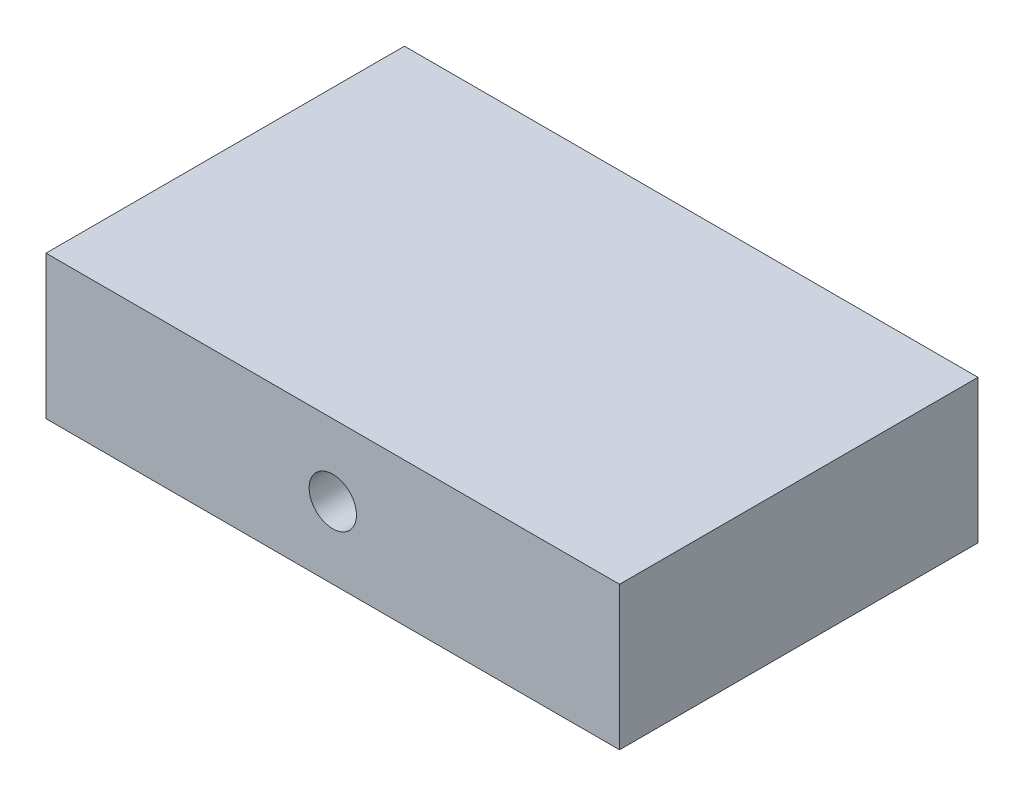
ISO-10303-21;
HEADER;
FILE_DESCRIPTION(('STEP AP214'),'2;1');
FILE_NAME('part.step','',(''),(''),'','','');
FILE_SCHEMA(('AUTOMOTIVE_DESIGN { 1 0 10303 214 1 1 1 1 }'));
ENDSEC;
DATA;
#1=APPLICATION_CONTEXT('core data for automotive mechanical design processes');
#2=APPLICATION_PROTOCOL_DEFINITION('international standard','automotive_design',2000,#1);
#3=PRODUCT_CONTEXT('',#1,'mechanical');
#4=PRODUCT('Part','Part','',(#3));
#5=PRODUCT_RELATED_PRODUCT_CATEGORY('part','',(#4));
#6=PRODUCT_DEFINITION_FORMATION('','',#4);
#7=PRODUCT_DEFINITION_CONTEXT('part definition',#1,'design');
#8=PRODUCT_DEFINITION('design','',#6,#7);
#9=PRODUCT_DEFINITION_SHAPE('','',#8);
#10=(LENGTH_UNIT() NAMED_UNIT(*) SI_UNIT(.MILLI.,.METRE.));
#11=(NAMED_UNIT(*) PLANE_ANGLE_UNIT() SI_UNIT($,.RADIAN.));
#12=(NAMED_UNIT(*) SI_UNIT($,.STERADIAN.) SOLID_ANGLE_UNIT());
#13=UNCERTAINTY_MEASURE_WITH_UNIT(LENGTH_MEASURE(1.E-05),#10,'distance_accuracy_value','');
#14=(GEOMETRIC_REPRESENTATION_CONTEXT(3) GLOBAL_UNCERTAINTY_ASSIGNED_CONTEXT((#13)) GLOBAL_UNIT_ASSIGNED_CONTEXT((#10,
#11,#12)) REPRESENTATION_CONTEXT('',''));
#15=CARTESIAN_POINT('',(0.,0.,0.));
#16=DIRECTION('',(0.,0.,1.));
#17=DIRECTION('',(1.,0.,0.));
#18=AXIS2_PLACEMENT_3D('',#15,#16,#17);
#19=CARTESIAN_POINT('',(0.,0.,25.));
#20=DIRECTION('',(1.,0.,0.));
#21=DIRECTION('',(0.,0.,-1.));
#22=AXIS2_PLACEMENT_3D('',#19,#20,#21);
#23=PLANE('',#22);
#24=DIRECTION('',(0.,-1.,0.));
#25=VECTOR('',#24,1.);
#26=CARTESIAN_POINT('',(0.,0.,0.));
#27=LINE('',#26,#25);
#28=CARTESIAN_POINT('',(0.,10.,0.));
#29=VERTEX_POINT('',#28);
#30=CARTESIAN_POINT('',(0.,0.,0.));
#31=VERTEX_POINT('',#30);
#32=EDGE_CURVE('E96',#29,#31,#27,.T.);
#33=ORIENTED_EDGE('',*,*,#32,.T.);
#34=DIRECTION('',(0.,0.,-1.));
#35=VECTOR('',#34,1.);
#36=CARTESIAN_POINT('',(0.,0.,25.));
#37=LINE('',#36,#35);
#38=CARTESIAN_POINT('',(0.,0.,25.));
#39=VERTEX_POINT('',#38);
#40=EDGE_CURVE('E11',#39,#31,#37,.T.);
#41=ORIENTED_EDGE('',*,*,#40,.F.);
#42=DIRECTION('',(0.,-1.,0.));
#43=VECTOR('',#42,1.);
#44=CARTESIAN_POINT('',(0.,0.,25.));
#45=LINE('',#44,#43);
#46=CARTESIAN_POINT('',(0.,10.,25.));
#47=VERTEX_POINT('',#46);
#48=EDGE_CURVE('E105',#47,#39,#45,.T.);
#49=ORIENTED_EDGE('',*,*,#48,.F.);
#50=DIRECTION('',(0.,0.,-1.));
#51=VECTOR('',#50,1.);
#52=CARTESIAN_POINT('',(0.,10.,25.));
#53=LINE('',#52,#51);
#54=EDGE_CURVE('E110',#47,#29,#53,.T.);
#55=ORIENTED_EDGE('',*,*,#54,.T.);
#56=EDGE_LOOP('',(#33,#41,#49,#55));
#57=FACE_BOUND('',#56,.T.);
#58=ADVANCED_FACE('F35',(#57),#23,.F.);
#59=CARTESIAN_POINT('',(0.,0.,25.));
#60=DIRECTION('',(0.,1.,0.));
#61=DIRECTION('',(0.,0.,1.));
#62=AXIS2_PLACEMENT_3D('',#59,#60,#61);
#63=PLANE('',#62);
#64=DIRECTION('',(1.,0.,0.));
#65=VECTOR('',#64,1.);
#66=CARTESIAN_POINT('',(0.,0.,0.));
#67=LINE('',#66,#65);
#68=CARTESIAN_POINT('',(40.,0.,0.));
#69=VERTEX_POINT('',#68);
#70=EDGE_CURVE('E100',#31,#69,#67,.T.);
#71=ORIENTED_EDGE('',*,*,#70,.T.);
#72=DIRECTION('',(0.,0.,-1.));
#73=VECTOR('',#72,1.);
#74=CARTESIAN_POINT('',(40.,0.,25.));
#75=LINE('',#74,#73);
#76=CARTESIAN_POINT('',(40.,0.,25.));
#77=VERTEX_POINT('',#76);
#78=EDGE_CURVE('E43',#77,#69,#75,.T.);
#79=ORIENTED_EDGE('',*,*,#78,.F.);
#80=DIRECTION('',(1.,0.,0.));
#81=VECTOR('',#80,1.);
#82=CARTESIAN_POINT('',(0.,0.,25.));
#83=LINE('',#82,#81);
#84=EDGE_CURVE('E82',#39,#77,#83,.T.);
#85=ORIENTED_EDGE('',*,*,#84,.F.);
#86=ORIENTED_EDGE('',*,*,#40,.T.);
#87=EDGE_LOOP('',(#71,#79,#85,#86));
#88=FACE_BOUND('',#87,.T.);
#89=ADVANCED_FACE('F134',(#88),#63,.F.);
#90=CARTESIAN_POINT('',(40.,0.,25.));
#91=DIRECTION('',(-1.,0.,0.));
#92=DIRECTION('',(0.,0.,1.));
#93=AXIS2_PLACEMENT_3D('',#90,#91,#92);
#94=PLANE('',#93);
#95=DIRECTION('',(0.,1.,0.));
#96=VECTOR('',#95,1.);
#97=CARTESIAN_POINT('',(40.,0.,0.));
#98=LINE('',#97,#96);
#99=CARTESIAN_POINT('',(40.,10.,0.));
#100=VERTEX_POINT('',#99);
#101=EDGE_CURVE('E69',#69,#100,#98,.T.);
#102=ORIENTED_EDGE('',*,*,#101,.T.);
#103=DIRECTION('',(0.,0.,-1.));
#104=VECTOR('',#103,1.);
#105=CARTESIAN_POINT('',(40.,10.,25.));
#106=LINE('',#105,#104);
#107=CARTESIAN_POINT('',(40.,10.,25.));
#108=VERTEX_POINT('',#107);
#109=EDGE_CURVE('E116',#108,#100,#106,.T.);
#110=ORIENTED_EDGE('',*,*,#109,.F.);
#111=DIRECTION('',(0.,1.,0.));
#112=VECTOR('',#111,1.);
#113=CARTESIAN_POINT('',(40.,0.,25.));
#114=LINE('',#113,#112);
#115=EDGE_CURVE('E108',#77,#108,#114,.T.);
#116=ORIENTED_EDGE('',*,*,#115,.F.);
#117=ORIENTED_EDGE('',*,*,#78,.T.);
#118=EDGE_LOOP('',(#102,#110,#116,#117));
#119=FACE_BOUND('',#118,.T.);
#120=ADVANCED_FACE('F118',(#119),#94,.F.);
#121=CARTESIAN_POINT('',(0.,10.,25.));
#122=DIRECTION('',(0.,-1.,0.));
#123=DIRECTION('',(0.,0.,-1.));
#124=AXIS2_PLACEMENT_3D('',#121,#122,#123);
#125=PLANE('',#124);
#126=DIRECTION('',(-1.,0.,0.));
#127=VECTOR('',#126,1.);
#128=CARTESIAN_POINT('',(0.,10.,0.));
#129=LINE('',#128,#127);
#130=EDGE_CURVE('E75',#100,#29,#129,.T.);
#131=ORIENTED_EDGE('',*,*,#130,.T.);
#132=ORIENTED_EDGE('',*,*,#54,.F.);
#133=DIRECTION('',(-1.,0.,0.));
#134=VECTOR('',#133,1.);
#135=CARTESIAN_POINT('',(0.,10.,25.));
#136=LINE('',#135,#134);
#137=EDGE_CURVE('E51',#108,#47,#136,.T.);
#138=ORIENTED_EDGE('',*,*,#137,.F.);
#139=ORIENTED_EDGE('',*,*,#109,.T.);
#140=EDGE_LOOP('',(#131,#132,#138,#139));
#141=FACE_BOUND('',#140,.T.);
#142=ADVANCED_FACE('F124',(#141),#125,.F.);
#143=CARTESIAN_POINT('',(0.,0.,25.));
#144=DIRECTION('',(0.,0.,-1.));
#145=DIRECTION('',(-1.,0.,0.));
#146=AXIS2_PLACEMENT_3D('',#143,#144,#145);
#147=PLANE('',#146);
#148=CARTESIAN_POINT('',(20.,5.,25.));
#149=DIRECTION('',(0.,0.,1.));
#150=DIRECTION('',(1.,0.,0.));
#151=AXIS2_PLACEMENT_3D('',#148,#149,#150);
#152=CIRCLE('',#151,1.64999999999999);
#153=CARTESIAN_POINT('',(21.65,5.,25.));
#154=VERTEX_POINT('',#153);
#155=EDGE_CURVE('E97',#154,#154,#152,.T.);
#156=ORIENTED_EDGE('',*,*,#155,.F.);
#157=EDGE_LOOP('',(#156));
#158=FACE_BOUND('',#157,.T.);
#159=ORIENTED_EDGE('',*,*,#48,.T.);
#160=ORIENTED_EDGE('',*,*,#84,.T.);
#161=ORIENTED_EDGE('',*,*,#115,.T.);
#162=ORIENTED_EDGE('',*,*,#137,.T.);
#163=EDGE_LOOP('',(#159,#160,#161,#162));
#164=FACE_BOUND('',#163,.T.);
#165=ADVANCED_FACE('F126',(#158,#164),#147,.F.);
#166=CARTESIAN_POINT('',(0.,0.,0.));
#167=DIRECTION('',(0.,0.,-1.));
#168=DIRECTION('',(-1.,0.,0.));
#169=AXIS2_PLACEMENT_3D('',#166,#167,#168);
#170=PLANE('',#169);
#171=ORIENTED_EDGE('',*,*,#32,.F.);
#172=ORIENTED_EDGE('',*,*,#130,.F.);
#173=ORIENTED_EDGE('',*,*,#101,.F.);
#174=ORIENTED_EDGE('',*,*,#70,.F.);
#175=EDGE_LOOP('',(#171,#172,#173,#174));
#176=FACE_BOUND('',#175,.T.);
#177=ADVANCED_FACE('F90',(#176),#170,.T.);
#178=CARTESIAN_POINT('',(20.,5.,15.5));
#179=DIRECTION('',(0.,0.,1.));
#180=DIRECTION('',(1.,0.,0.));
#181=AXIS2_PLACEMENT_3D('',#178,#179,#180);
#182=CONICAL_SURFACE('',#181,1.64999999999999,1.02974425867665);
#183=CARTESIAN_POINT('',(20.,5.,14.5085799786045));
#184=VERTEX_POINT('',#183);
#185=VERTEX_LOOP('',#184);
#186=FACE_BOUND('',#185,.T.);
#187=CARTESIAN_POINT('',(20.,5.,15.5));
#188=DIRECTION('',(0.,0.,1.));
#189=DIRECTION('',(1.,0.,0.));
#190=AXIS2_PLACEMENT_3D('',#187,#188,#189);
#191=CIRCLE('',#190,1.64999999999999);
#192=CARTESIAN_POINT('',(21.65,5.,15.5));
#193=VERTEX_POINT('',#192);
#194=EDGE_CURVE('E94',#193,#193,#191,.T.);
#195=ORIENTED_EDGE('',*,*,#194,.T.);
#196=EDGE_LOOP('',(#195));
#197=FACE_BOUND('',#196,.T.);
#198=ADVANCED_FACE('F86',(#186,#197),#182,.F.);
#199=CARTESIAN_POINT('',(20.,5.,25.));
#200=DIRECTION('',(0.,0.,1.));
#201=DIRECTION('',(1.,0.,0.));
#202=AXIS2_PLACEMENT_3D('',#199,#200,#201);
#203=CYLINDRICAL_SURFACE('',#202,1.64999999999999);
#204=ORIENTED_EDGE('',*,*,#194,.F.);
#205=EDGE_LOOP('',(#204));
#206=FACE_BOUND('',#205,.T.);
#207=ORIENTED_EDGE('',*,*,#155,.T.);
#208=EDGE_LOOP('',(#207));
#209=FACE_BOUND('',#208,.T.);
#210=ADVANCED_FACE('F89',(#206,#209),#203,.F.);
#211=CLOSED_SHELL('',(#58,#89,#120,#142,#165,#177,#198,#210));
#212=MANIFOLD_SOLID_BREP('B2',#211);
#213=ADVANCED_BREP_SHAPE_REPRESENTATION('',(#18,#212),#14);
#214=SHAPE_DEFINITION_REPRESENTATION(#9,#213);
ENDSEC;
END-ISO-10303-21;
